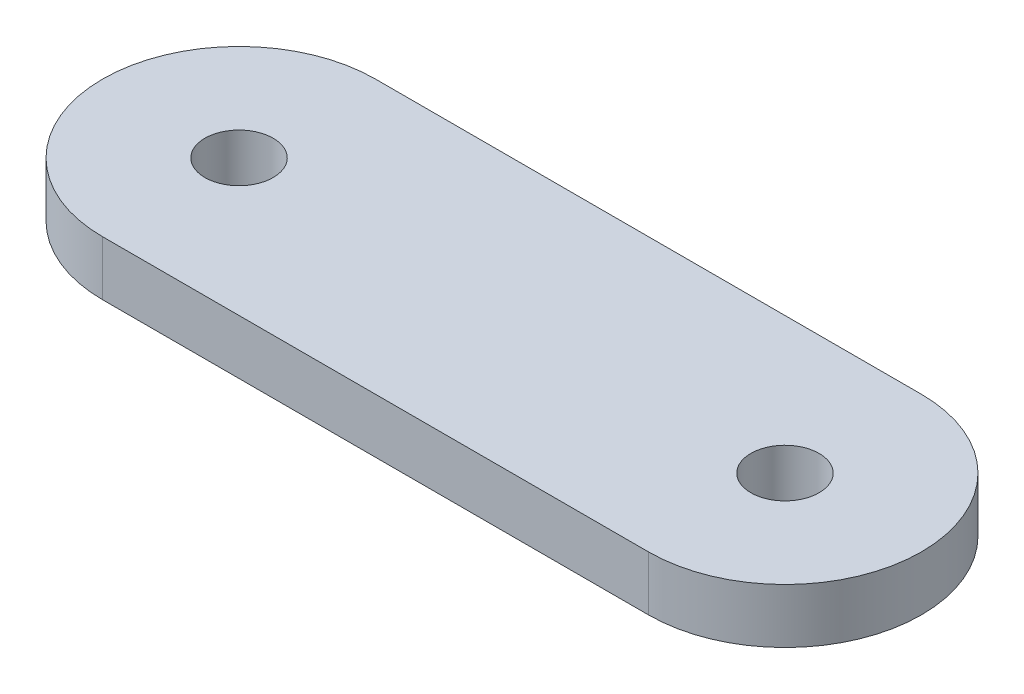
ISO-10303-21;
HEADER;
FILE_DESCRIPTION(('STEP AP214'),'2;1');
FILE_NAME('part.step','',(''),(''),'','','');
FILE_SCHEMA(('AUTOMOTIVE_DESIGN { 1 0 10303 214 1 1 1 1 }'));
ENDSEC;
DATA;
#1=APPLICATION_CONTEXT('core data for automotive mechanical design processes');
#2=APPLICATION_PROTOCOL_DEFINITION('international standard','automotive_design',2000,#1);
#3=PRODUCT_CONTEXT('',#1,'mechanical');
#4=PRODUCT('Part','Part','',(#3));
#5=PRODUCT_RELATED_PRODUCT_CATEGORY('part','',(#4));
#6=PRODUCT_DEFINITION_FORMATION('','',#4);
#7=PRODUCT_DEFINITION_CONTEXT('part definition',#1,'design');
#8=PRODUCT_DEFINITION('design','',#6,#7);
#9=PRODUCT_DEFINITION_SHAPE('','',#8);
#10=(LENGTH_UNIT() NAMED_UNIT(*) SI_UNIT(.MILLI.,.METRE.));
#11=(NAMED_UNIT(*) PLANE_ANGLE_UNIT() SI_UNIT($,.RADIAN.));
#12=(NAMED_UNIT(*) SI_UNIT($,.STERADIAN.) SOLID_ANGLE_UNIT());
#13=UNCERTAINTY_MEASURE_WITH_UNIT(LENGTH_MEASURE(1.E-05),#10,'distance_accuracy_value','');
#14=(GEOMETRIC_REPRESENTATION_CONTEXT(3) GLOBAL_UNCERTAINTY_ASSIGNED_CONTEXT((#13)) GLOBAL_UNIT_ASSIGNED_CONTEXT((#10,
#11,#12)) REPRESENTATION_CONTEXT('',''));
#15=CARTESIAN_POINT('',(0.,0.,0.));
#16=DIRECTION('',(0.,0.,1.));
#17=DIRECTION('',(1.,0.,0.));
#18=AXIS2_PLACEMENT_3D('',#15,#16,#17);
#19=CARTESIAN_POINT('',(0.,2.,0.));
#20=DIRECTION('',(0.,1.,0.));
#21=DIRECTION('',(0.,0.,1.));
#22=AXIS2_PLACEMENT_3D('',#19,#20,#21);
#23=PLANE('',#22);
#24=CARTESIAN_POINT('',(0.,2.,0.));
#25=DIRECTION('',(0.,1.,0.));
#26=DIRECTION('',(0.,0.,1.));
#27=AXIS2_PLACEMENT_3D('',#24,#25,#26);
#28=CIRCLE('',#27,1.25);
#29=CARTESIAN_POINT('',(0.,2.,1.25));
#30=VERTEX_POINT('',#29);
#31=EDGE_CURVE('E101',#30,#30,#28,.T.);
#32=ORIENTED_EDGE('',*,*,#31,.F.);
#33=EDGE_LOOP('',(#32));
#34=FACE_BOUND('',#33,.T.);
#35=CARTESIAN_POINT('',(0.,2.,0.));
#36=DIRECTION('',(0.,1.,0.));
#37=DIRECTION('',(0.,0.,1.));
#38=AXIS2_PLACEMENT_3D('',#35,#36,#37);
#39=CIRCLE('',#38,5.);
#40=CARTESIAN_POINT('',(0.,2.,-5.));
#41=VERTEX_POINT('',#40);
#42=CARTESIAN_POINT('',(0.,2.,5.));
#43=VERTEX_POINT('',#42);
#44=EDGE_CURVE('E86',#41,#43,#39,.T.);
#45=ORIENTED_EDGE('',*,*,#44,.T.);
#46=DIRECTION('',(1.,0.,0.));
#47=VECTOR('',#46,1.);
#48=CARTESIAN_POINT('',(0.,2.,5.));
#49=LINE('',#48,#47);
#50=CARTESIAN_POINT('',(20.,2.,5.));
#51=VERTEX_POINT('',#50);
#52=EDGE_CURVE('E81',#43,#51,#49,.T.);
#53=ORIENTED_EDGE('',*,*,#52,.T.);
#54=CARTESIAN_POINT('',(20.,2.,0.));
#55=DIRECTION('',(0.,1.,0.));
#56=DIRECTION('',(0.,0.,1.));
#57=AXIS2_PLACEMENT_3D('',#54,#55,#56);
#58=CIRCLE('',#57,5.);
#59=CARTESIAN_POINT('',(20.,2.,-5.));
#60=VERTEX_POINT('',#59);
#61=EDGE_CURVE('E84',#51,#60,#58,.T.);
#62=ORIENTED_EDGE('',*,*,#61,.T.);
#63=DIRECTION('',(-1.,0.,0.));
#64=VECTOR('',#63,1.);
#65=CARTESIAN_POINT('',(0.,2.,-5.));
#66=LINE('',#65,#64);
#67=EDGE_CURVE('E51',#60,#41,#66,.T.);
#68=ORIENTED_EDGE('',*,*,#67,.T.);
#69=EDGE_LOOP('',(#45,#53,#62,#68));
#70=FACE_BOUND('',#69,.T.);
#71=CARTESIAN_POINT('',(20.,2.,0.));
#72=DIRECTION('',(0.,1.,0.));
#73=DIRECTION('',(0.,0.,1.));
#74=AXIS2_PLACEMENT_3D('',#71,#72,#73);
#75=CIRCLE('',#74,1.25);
#76=CARTESIAN_POINT('',(20.,2.,1.25));
#77=VERTEX_POINT('',#76);
#78=EDGE_CURVE('E116',#77,#77,#75,.T.);
#79=ORIENTED_EDGE('',*,*,#78,.F.);
#80=EDGE_LOOP('',(#79));
#81=FACE_BOUND('',#80,.T.);
#82=ADVANCED_FACE('F34',(#34,#70,#81),#23,.T.);
#83=CARTESIAN_POINT('',(0.,0.,0.));
#84=DIRECTION('',(0.,1.,0.));
#85=DIRECTION('',(0.,0.,1.));
#86=AXIS2_PLACEMENT_3D('',#83,#84,#85);
#87=PLANE('',#86);
#88=CARTESIAN_POINT('',(0.,0.,0.));
#89=DIRECTION('',(0.,1.,0.));
#90=DIRECTION('',(0.,0.,1.));
#91=AXIS2_PLACEMENT_3D('',#88,#89,#90);
#92=CIRCLE('',#91,5.);
#93=CARTESIAN_POINT('',(0.,0.,-5.));
#94=VERTEX_POINT('',#93);
#95=CARTESIAN_POINT('',(0.,0.,5.));
#96=VERTEX_POINT('',#95);
#97=EDGE_CURVE('E98',#94,#96,#92,.T.);
#98=ORIENTED_EDGE('',*,*,#97,.F.);
#99=DIRECTION('',(-1.,0.,0.));
#100=VECTOR('',#99,1.);
#101=CARTESIAN_POINT('',(0.,0.,-5.));
#102=LINE('',#101,#100);
#103=CARTESIAN_POINT('',(20.,0.,-5.));
#104=VERTEX_POINT('',#103);
#105=EDGE_CURVE('E74',#104,#94,#102,.T.);
#106=ORIENTED_EDGE('',*,*,#105,.F.);
#107=CARTESIAN_POINT('',(20.,0.,0.));
#108=DIRECTION('',(0.,1.,0.));
#109=DIRECTION('',(0.,0.,1.));
#110=AXIS2_PLACEMENT_3D('',#107,#108,#109);
#111=CIRCLE('',#110,5.);
#112=CARTESIAN_POINT('',(20.,0.,5.));
#113=VERTEX_POINT('',#112);
#114=EDGE_CURVE('E68',#113,#104,#111,.T.);
#115=ORIENTED_EDGE('',*,*,#114,.F.);
#116=DIRECTION('',(1.,0.,0.));
#117=VECTOR('',#116,1.);
#118=CARTESIAN_POINT('',(0.,0.,5.));
#119=LINE('',#118,#117);
#120=EDGE_CURVE('E90',#96,#113,#119,.T.);
#121=ORIENTED_EDGE('',*,*,#120,.F.);
#122=EDGE_LOOP('',(#98,#106,#115,#121));
#123=FACE_BOUND('',#122,.T.);
#124=CARTESIAN_POINT('',(0.,0.,0.));
#125=DIRECTION('',(0.,1.,0.));
#126=DIRECTION('',(0.,0.,1.));
#127=AXIS2_PLACEMENT_3D('',#124,#125,#126);
#128=CIRCLE('',#127,1.25);
#129=CARTESIAN_POINT('',(0.,0.,1.25));
#130=VERTEX_POINT('',#129);
#131=EDGE_CURVE('E113',#130,#130,#128,.T.);
#132=ORIENTED_EDGE('',*,*,#131,.T.);
#133=EDGE_LOOP('',(#132));
#134=FACE_BOUND('',#133,.T.);
#135=CARTESIAN_POINT('',(20.,0.,0.));
#136=DIRECTION('',(0.,1.,0.));
#137=DIRECTION('',(0.,0.,1.));
#138=AXIS2_PLACEMENT_3D('',#135,#136,#137);
#139=CIRCLE('',#138,1.25);
#140=CARTESIAN_POINT('',(20.,0.,1.25));
#141=VERTEX_POINT('',#140);
#142=EDGE_CURVE('E119',#141,#141,#139,.T.);
#143=ORIENTED_EDGE('',*,*,#142,.T.);
#144=EDGE_LOOP('',(#143));
#145=FACE_BOUND('',#144,.T.);
#146=ADVANCED_FACE('F109',(#123,#134,#145),#87,.F.);
#147=CARTESIAN_POINT('',(0.,2.,0.));
#148=DIRECTION('',(0.,-1.,0.));
#149=DIRECTION('',(0.,0.,-1.));
#150=AXIS2_PLACEMENT_3D('',#147,#148,#149);
#151=CYLINDRICAL_SURFACE('',#150,5.);
#152=ORIENTED_EDGE('',*,*,#97,.T.);
#153=DIRECTION('',(0.,-1.,0.));
#154=VECTOR('',#153,1.);
#155=CARTESIAN_POINT('',(0.,2.,5.));
#156=LINE('',#155,#154);
#157=EDGE_CURVE('E11',#43,#96,#156,.T.);
#158=ORIENTED_EDGE('',*,*,#157,.F.);
#159=ORIENTED_EDGE('',*,*,#44,.F.);
#160=DIRECTION('',(0.,-1.,0.));
#161=VECTOR('',#160,1.);
#162=CARTESIAN_POINT('',(0.,2.,-5.));
#163=LINE('',#162,#161);
#164=EDGE_CURVE('E94',#41,#94,#163,.T.);
#165=ORIENTED_EDGE('',*,*,#164,.T.);
#166=EDGE_LOOP('',(#152,#158,#159,#165));
#167=FACE_BOUND('',#166,.T.);
#168=ADVANCED_FACE('F36',(#167),#151,.T.);
#169=CARTESIAN_POINT('',(0.,2.,5.));
#170=DIRECTION('',(0.,0.,-1.));
#171=DIRECTION('',(-1.,0.,0.));
#172=AXIS2_PLACEMENT_3D('',#169,#170,#171);
#173=PLANE('',#172);
#174=ORIENTED_EDGE('',*,*,#120,.T.);
#175=DIRECTION('',(0.,-1.,0.));
#176=VECTOR('',#175,1.);
#177=CARTESIAN_POINT('',(20.,2.,5.));
#178=LINE('',#177,#176);
#179=EDGE_CURVE('E43',#51,#113,#178,.T.);
#180=ORIENTED_EDGE('',*,*,#179,.F.);
#181=ORIENTED_EDGE('',*,*,#52,.F.);
#182=ORIENTED_EDGE('',*,*,#157,.T.);
#183=EDGE_LOOP('',(#174,#180,#181,#182));
#184=FACE_BOUND('',#183,.T.);
#185=ADVANCED_FACE('F89',(#184),#173,.F.);
#186=CARTESIAN_POINT('',(20.,2.,0.));
#187=DIRECTION('',(0.,-1.,0.));
#188=DIRECTION('',(0.,0.,-1.));
#189=AXIS2_PLACEMENT_3D('',#186,#187,#188);
#190=CYLINDRICAL_SURFACE('',#189,5.);
#191=ORIENTED_EDGE('',*,*,#114,.T.);
#192=DIRECTION('',(0.,-1.,0.));
#193=VECTOR('',#192,1.);
#194=CARTESIAN_POINT('',(20.,2.,-5.));
#195=LINE('',#194,#193);
#196=EDGE_CURVE('E91',#60,#104,#195,.T.);
#197=ORIENTED_EDGE('',*,*,#196,.F.);
#198=ORIENTED_EDGE('',*,*,#61,.F.);
#199=ORIENTED_EDGE('',*,*,#179,.T.);
#200=EDGE_LOOP('',(#191,#197,#198,#199));
#201=FACE_BOUND('',#200,.T.);
#202=ADVANCED_FACE('F92',(#201),#190,.T.);
#203=CARTESIAN_POINT('',(0.,2.,-5.));
#204=DIRECTION('',(0.,0.,1.));
#205=DIRECTION('',(1.,0.,0.));
#206=AXIS2_PLACEMENT_3D('',#203,#204,#205);
#207=PLANE('',#206);
#208=ORIENTED_EDGE('',*,*,#105,.T.);
#209=ORIENTED_EDGE('',*,*,#164,.F.);
#210=ORIENTED_EDGE('',*,*,#67,.F.);
#211=ORIENTED_EDGE('',*,*,#196,.T.);
#212=EDGE_LOOP('',(#208,#209,#210,#211));
#213=FACE_BOUND('',#212,.T.);
#214=ADVANCED_FACE('F106',(#213),#207,.F.);
#215=CARTESIAN_POINT('',(0.,2.,0.));
#216=DIRECTION('',(0.,-1.,0.));
#217=DIRECTION('',(0.,0.,-1.));
#218=AXIS2_PLACEMENT_3D('',#215,#216,#217);
#219=CYLINDRICAL_SURFACE('',#218,1.25);
#220=ORIENTED_EDGE('',*,*,#31,.T.);
#221=EDGE_LOOP('',(#220));
#222=FACE_BOUND('',#221,.T.);
#223=ORIENTED_EDGE('',*,*,#131,.F.);
#224=EDGE_LOOP('',(#223));
#225=FACE_BOUND('',#224,.T.);
#226=ADVANCED_FACE('F136',(#222,#225),#219,.F.);
#227=CARTESIAN_POINT('',(20.,2.,0.));
#228=DIRECTION('',(0.,-1.,0.));
#229=DIRECTION('',(0.,0.,-1.));
#230=AXIS2_PLACEMENT_3D('',#227,#228,#229);
#231=CYLINDRICAL_SURFACE('',#230,1.25);
#232=ORIENTED_EDGE('',*,*,#78,.T.);
#233=EDGE_LOOP('',(#232));
#234=FACE_BOUND('',#233,.T.);
#235=ORIENTED_EDGE('',*,*,#142,.F.);
#236=EDGE_LOOP('',(#235));
#237=FACE_BOUND('',#236,.T.);
#238=ADVANCED_FACE('F125',(#234,#237),#231,.F.);
#239=CLOSED_SHELL('',(#82,#146,#168,#185,#202,#214,#226,#238));
#240=MANIFOLD_SOLID_BREP('B2',#239);
#241=ADVANCED_BREP_SHAPE_REPRESENTATION('',(#18,#240),#14);
#242=SHAPE_DEFINITION_REPRESENTATION(#9,#241);
ENDSEC;
END-ISO-10303-21;
